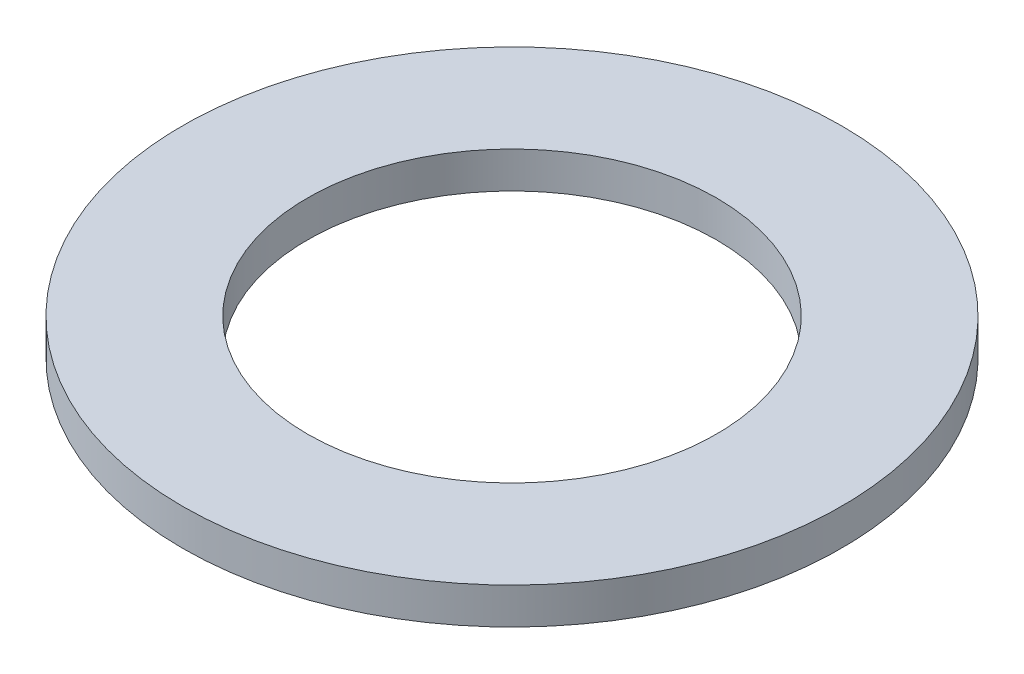
ISO-10303-21;
HEADER;
FILE_DESCRIPTION(('STEP AP214'),'2;1');
FILE_NAME('part.step','',(''),(''),'','','');
FILE_SCHEMA(('AUTOMOTIVE_DESIGN { 1 0 10303 214 1 1 1 1 }'));
ENDSEC;
DATA;
#1=APPLICATION_CONTEXT('core data for automotive mechanical design processes');
#2=APPLICATION_PROTOCOL_DEFINITION('international standard','automotive_design',2000,#1);
#3=PRODUCT_CONTEXT('',#1,'mechanical');
#4=PRODUCT('Part','Part','',(#3));
#5=PRODUCT_RELATED_PRODUCT_CATEGORY('part','',(#4));
#6=PRODUCT_DEFINITION_FORMATION('','',#4);
#7=PRODUCT_DEFINITION_CONTEXT('part definition',#1,'design');
#8=PRODUCT_DEFINITION('design','',#6,#7);
#9=PRODUCT_DEFINITION_SHAPE('','',#8);
#10=(LENGTH_UNIT() NAMED_UNIT(*) SI_UNIT(.MILLI.,.METRE.));
#11=(NAMED_UNIT(*) PLANE_ANGLE_UNIT() SI_UNIT($,.RADIAN.));
#12=(NAMED_UNIT(*) SI_UNIT($,.STERADIAN.) SOLID_ANGLE_UNIT());
#13=UNCERTAINTY_MEASURE_WITH_UNIT(LENGTH_MEASURE(1.E-05),#10,'distance_accuracy_value','');
#14=(GEOMETRIC_REPRESENTATION_CONTEXT(3) GLOBAL_UNCERTAINTY_ASSIGNED_CONTEXT((#13)) GLOBAL_UNIT_ASSIGNED_CONTEXT((#10,
#11,#12)) REPRESENTATION_CONTEXT('',''));
#15=CARTESIAN_POINT('',(0.,0.,0.));
#16=DIRECTION('',(0.,0.,1.));
#17=DIRECTION('',(1.,0.,0.));
#18=AXIS2_PLACEMENT_3D('',#15,#16,#17);
#19=CARTESIAN_POINT('',(0.,8.,0.));
#20=DIRECTION('',(0.,-1.,0.));
#21=DIRECTION('',(0.,0.,-1.));
#22=AXIS2_PLACEMENT_3D('',#19,#20,#21);
#23=CYLINDRICAL_SURFACE('',#22,72.5);
#24=CARTESIAN_POINT('',(0.,8.,0.));
#25=DIRECTION('',(0.,1.,0.));
#26=DIRECTION('',(0.,0.,1.));
#27=AXIS2_PLACEMENT_3D('',#24,#25,#26);
#28=CIRCLE('',#27,72.5);
#29=CARTESIAN_POINT('',(0.,8.,72.5));
#30=VERTEX_POINT('',#29);
#31=EDGE_CURVE('E10',#30,#30,#28,.T.);
#32=ORIENTED_EDGE('',*,*,#31,.F.);
#33=EDGE_LOOP('',(#32));
#34=FACE_BOUND('',#33,.T.);
#35=CARTESIAN_POINT('',(0.,0.,0.));
#36=DIRECTION('',(0.,1.,0.));
#37=DIRECTION('',(0.,0.,1.));
#38=AXIS2_PLACEMENT_3D('',#35,#36,#37);
#39=CIRCLE('',#38,72.5);
#40=CARTESIAN_POINT('',(0.,0.,72.5));
#41=VERTEX_POINT('',#40);
#42=EDGE_CURVE('E37',#41,#41,#39,.T.);
#43=ORIENTED_EDGE('',*,*,#42,.T.);
#44=EDGE_LOOP('',(#43));
#45=FACE_BOUND('',#44,.T.);
#46=ADVANCED_FACE('F40',(#34,#45),#23,.T.);
#47=CARTESIAN_POINT('',(0.,8.,0.));
#48=DIRECTION('',(0.,1.,0.));
#49=DIRECTION('',(0.,0.,1.));
#50=AXIS2_PLACEMENT_3D('',#47,#48,#49);
#51=PLANE('',#50);
#52=CARTESIAN_POINT('',(0.,8.,0.));
#53=DIRECTION('',(0.,1.,0.));
#54=DIRECTION('',(0.,0.,1.));
#55=AXIS2_PLACEMENT_3D('',#52,#53,#54);
#56=CIRCLE('',#55,45.);
#57=CARTESIAN_POINT('',(0.,8.,45.));
#58=VERTEX_POINT('',#57);
#59=EDGE_CURVE('E50',#58,#58,#56,.T.);
#60=ORIENTED_EDGE('',*,*,#59,.F.);
#61=EDGE_LOOP('',(#60));
#62=FACE_BOUND('',#61,.T.);
#63=ORIENTED_EDGE('',*,*,#31,.T.);
#64=EDGE_LOOP('',(#63));
#65=FACE_BOUND('',#64,.T.);
#66=ADVANCED_FACE('F59',(#62,#65),#51,.T.);
#67=CARTESIAN_POINT('',(0.,0.,0.));
#68=DIRECTION('',(0.,1.,0.));
#69=DIRECTION('',(0.,0.,1.));
#70=AXIS2_PLACEMENT_3D('',#67,#68,#69);
#71=PLANE('',#70);
#72=CARTESIAN_POINT('',(0.,0.,0.));
#73=DIRECTION('',(0.,1.,0.));
#74=DIRECTION('',(0.,0.,1.));
#75=AXIS2_PLACEMENT_3D('',#72,#73,#74);
#76=CIRCLE('',#75,45.);
#77=CARTESIAN_POINT('',(0.,0.,45.));
#78=VERTEX_POINT('',#77);
#79=EDGE_CURVE('E47',#78,#78,#76,.T.);
#80=ORIENTED_EDGE('',*,*,#79,.T.);
#81=EDGE_LOOP('',(#80));
#82=FACE_BOUND('',#81,.T.);
#83=ORIENTED_EDGE('',*,*,#42,.F.);
#84=EDGE_LOOP('',(#83));
#85=FACE_BOUND('',#84,.T.);
#86=ADVANCED_FACE('F58',(#82,#85),#71,.F.);
#87=CARTESIAN_POINT('',(0.,8.,0.));
#88=DIRECTION('',(0.,-1.,0.));
#89=DIRECTION('',(0.,0.,-1.));
#90=AXIS2_PLACEMENT_3D('',#87,#88,#89);
#91=CYLINDRICAL_SURFACE('',#90,45.);
#92=ORIENTED_EDGE('',*,*,#59,.T.);
#93=EDGE_LOOP('',(#92));
#94=FACE_BOUND('',#93,.T.);
#95=ORIENTED_EDGE('',*,*,#79,.F.);
#96=EDGE_LOOP('',(#95));
#97=FACE_BOUND('',#96,.T.);
#98=ADVANCED_FACE('F54',(#94,#97),#91,.F.);
#99=CLOSED_SHELL('',(#46,#66,#86,#98));
#100=MANIFOLD_SOLID_BREP('B2',#99);
#101=ADVANCED_BREP_SHAPE_REPRESENTATION('',(#18,#100),#14);
#102=SHAPE_DEFINITION_REPRESENTATION(#9,#101);
ENDSEC;
END-ISO-10303-21;
